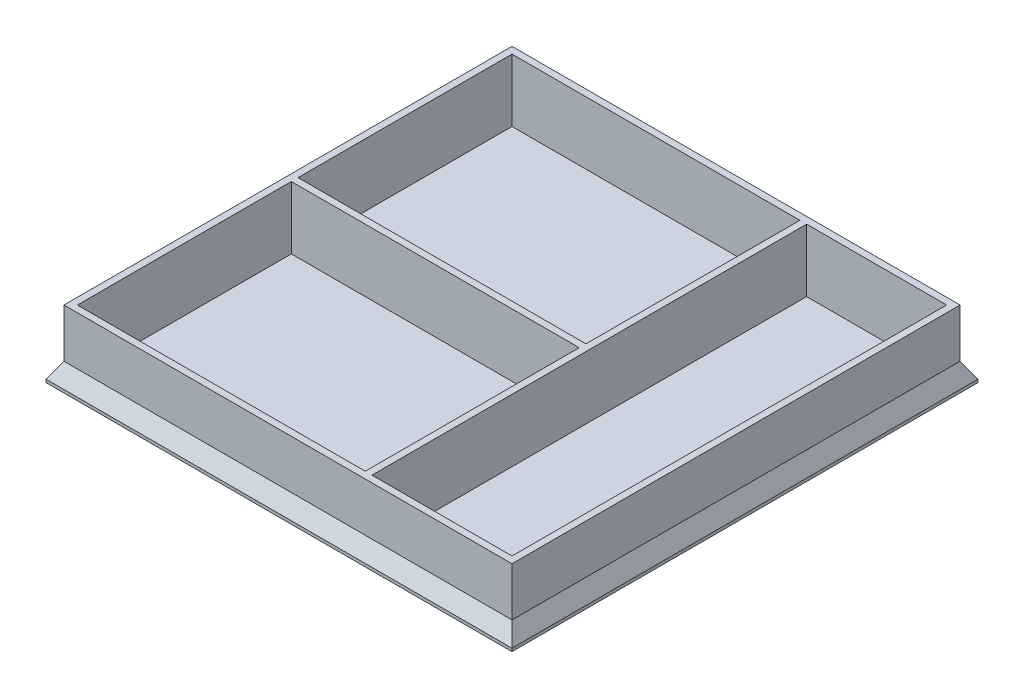
ISO-10303-21;
HEADER;
FILE_DESCRIPTION(('STEP AP214'),'2;1');
FILE_NAME('part.step','',(''),(''),'','','');
FILE_SCHEMA(('AUTOMOTIVE_DESIGN { 1 0 10303 214 1 1 1 1 }'));
ENDSEC;
DATA;
#1=APPLICATION_CONTEXT('core data for automotive mechanical design processes');
#2=APPLICATION_PROTOCOL_DEFINITION('international standard','automotive_design',2000,#1);
#3=PRODUCT_CONTEXT('',#1,'mechanical');
#4=PRODUCT('Part','Part','',(#3));
#5=PRODUCT_RELATED_PRODUCT_CATEGORY('part','',(#4));
#6=PRODUCT_DEFINITION_FORMATION('','',#4);
#7=PRODUCT_DEFINITION_CONTEXT('part definition',#1,'design');
#8=PRODUCT_DEFINITION('design','',#6,#7);
#9=PRODUCT_DEFINITION_SHAPE('','',#8);
#10=(LENGTH_UNIT() NAMED_UNIT(*) SI_UNIT(.MILLI.,.METRE.));
#11=(NAMED_UNIT(*) PLANE_ANGLE_UNIT() SI_UNIT($,.RADIAN.));
#12=(NAMED_UNIT(*) SI_UNIT($,.STERADIAN.) SOLID_ANGLE_UNIT());
#13=UNCERTAINTY_MEASURE_WITH_UNIT(LENGTH_MEASURE(1.E-05),#10,'distance_accuracy_value','');
#14=(GEOMETRIC_REPRESENTATION_CONTEXT(3) GLOBAL_UNCERTAINTY_ASSIGNED_CONTEXT((#13)) GLOBAL_UNIT_ASSIGNED_CONTEXT((#10,
#11,#12)) REPRESENTATION_CONTEXT('',''));
#15=CARTESIAN_POINT('',(0.,0.,0.));
#16=DIRECTION('',(0.,0.,1.));
#17=DIRECTION('',(1.,0.,0.));
#18=AXIS2_PLACEMENT_3D('',#15,#16,#17);
#19=CARTESIAN_POINT('',(0.,12.,-41.));
#20=DIRECTION('',(0.,0.,-1.));
#21=DIRECTION('',(-1.,0.,0.));
#22=AXIS2_PLACEMENT_3D('',#19,#20,#21);
#23=PLANE('',#22);
#24=DIRECTION('',(-1.,0.,0.));
#25=VECTOR('',#24,1.);
#26=CARTESIAN_POINT('',(0.,0.8,-41.));
#27=LINE('',#26,#25);
#28=CARTESIAN_POINT('',(-29.,0.8,-41.));
#29=VERTEX_POINT('',#28);
#30=CARTESIAN_POINT('',(-80.4,0.8,-41.));
#31=VERTEX_POINT('',#30);
#32=EDGE_CURVE('E306',#29,#31,#27,.T.);
#33=ORIENTED_EDGE('',*,*,#32,.F.);
#34=DIRECTION('',(0.,-1.,0.));
#35=VECTOR('',#34,1.);
#36=CARTESIAN_POINT('',(-29.,12.,-41.));
#37=LINE('',#36,#35);
#38=CARTESIAN_POINT('',(-29.,12.,-41.));
#39=VERTEX_POINT('',#38);
#40=EDGE_CURVE('E250',#39,#29,#37,.T.);
#41=ORIENTED_EDGE('',*,*,#40,.F.);
#42=DIRECTION('',(1.,0.,0.));
#43=VECTOR('',#42,1.);
#44=CARTESIAN_POINT('',(0.,12.,-41.));
#45=LINE('',#44,#43);
#46=CARTESIAN_POINT('',(-80.4,12.,-41.));
#47=VERTEX_POINT('',#46);
#48=EDGE_CURVE('E229',#47,#39,#45,.T.);
#49=ORIENTED_EDGE('',*,*,#48,.F.);
#50=DIRECTION('',(0.,-1.,0.));
#51=VECTOR('',#50,1.);
#52=CARTESIAN_POINT('',(-80.4,12.,-41.));
#53=LINE('',#52,#51);
#54=EDGE_CURVE('E240',#47,#31,#53,.T.);
#55=ORIENTED_EDGE('',*,*,#54,.T.);
#56=EDGE_LOOP('',(#33,#41,#49,#55));
#57=FACE_BOUND('',#56,.T.);
#58=ADVANCED_FACE('F37',(#57),#23,.F.);
#59=CARTESIAN_POINT('',(-29.,12.,0.));
#60=DIRECTION('',(1.,0.,0.));
#61=DIRECTION('',(0.,0.,-1.));
#62=AXIS2_PLACEMENT_3D('',#59,#60,#61);
#63=PLANE('',#62);
#64=DIRECTION('',(0.,0.,-1.));
#65=VECTOR('',#64,1.);
#66=CARTESIAN_POINT('',(-29.,0.8,0.));
#67=LINE('',#66,#65);
#68=CARTESIAN_POINT('',(-29.,0.8,-2.79999999999999));
#69=VERTEX_POINT('',#68);
#70=EDGE_CURVE('E304',#69,#29,#67,.T.);
#71=ORIENTED_EDGE('',*,*,#70,.F.);
#72=DIRECTION('',(0.,-1.,0.));
#73=VECTOR('',#72,1.);
#74=CARTESIAN_POINT('',(-29.,12.,-2.79999999999999));
#75=LINE('',#74,#73);
#76=CARTESIAN_POINT('',(-29.,12.,-2.79999999999999));
#77=VERTEX_POINT('',#76);
#78=EDGE_CURVE('E247',#77,#69,#75,.T.);
#79=ORIENTED_EDGE('',*,*,#78,.F.);
#80=DIRECTION('',(0.,0.,1.));
#81=VECTOR('',#80,1.);
#82=CARTESIAN_POINT('',(-29.,12.,0.));
#83=LINE('',#82,#81);
#84=EDGE_CURVE('E232',#39,#77,#83,.T.);
#85=ORIENTED_EDGE('',*,*,#84,.F.);
#86=ORIENTED_EDGE('',*,*,#40,.T.);
#87=EDGE_LOOP('',(#71,#79,#85,#86));
#88=FACE_BOUND('',#87,.T.);
#89=ADVANCED_FACE('F383',(#88),#63,.F.);
#90=CARTESIAN_POINT('',(0.,12.,-2.79999999999999));
#91=DIRECTION('',(0.,0.,-1.));
#92=DIRECTION('',(-1.,0.,0.));
#93=AXIS2_PLACEMENT_3D('',#90,#91,#92);
#94=PLANE('',#93);
#95=ORIENTED_EDGE('',*,*,#78,.T.);
#96=DIRECTION('',(-1.,0.,0.));
#97=VECTOR('',#96,1.);
#98=CARTESIAN_POINT('',(0.,0.8,-2.79999999999999));
#99=LINE('',#98,#97);
#100=CARTESIAN_POINT('',(-80.4,0.8,-2.79999999999999));
#101=VERTEX_POINT('',#100);
#102=EDGE_CURVE('E301',#69,#101,#99,.T.);
#103=ORIENTED_EDGE('',*,*,#102,.T.);
#104=DIRECTION('',(0.,-1.,0.));
#105=VECTOR('',#104,1.);
#106=CARTESIAN_POINT('',(-80.4,12.,-2.79999999999999));
#107=LINE('',#106,#105);
#108=CARTESIAN_POINT('',(-80.4,12.,-2.79999999999999));
#109=VERTEX_POINT('',#108);
#110=EDGE_CURVE('E243',#109,#101,#107,.T.);
#111=ORIENTED_EDGE('',*,*,#110,.F.);
#112=DIRECTION('',(1.,0.,0.));
#113=VECTOR('',#112,1.);
#114=CARTESIAN_POINT('',(0.,12.,-2.79999999999999));
#115=LINE('',#114,#113);
#116=EDGE_CURVE('E234',#109,#77,#115,.T.);
#117=ORIENTED_EDGE('',*,*,#116,.T.);
#118=EDGE_LOOP('',(#95,#103,#111,#117));
#119=FACE_BOUND('',#118,.T.);
#120=ADVANCED_FACE('F389',(#119),#94,.T.);
#121=CARTESIAN_POINT('',(0.,12.,-80.4));
#122=DIRECTION('',(0.,0.,-1.));
#123=DIRECTION('',(-1.,0.,0.));
#124=AXIS2_PLACEMENT_3D('',#121,#122,#123);
#125=PLANE('',#124);
#126=DIRECTION('',(-1.,0.,0.));
#127=VECTOR('',#126,1.);
#128=CARTESIAN_POINT('',(0.,0.8,-80.4));
#129=LINE('',#128,#127);
#130=CARTESIAN_POINT('',(-29.,0.8,-80.4));
#131=VERTEX_POINT('',#130);
#132=CARTESIAN_POINT('',(-80.4,0.8,-80.4));
#133=VERTEX_POINT('',#132);
#134=EDGE_CURVE('E299',#131,#133,#129,.T.);
#135=ORIENTED_EDGE('',*,*,#134,.F.);
#136=DIRECTION('',(0.,-1.,0.));
#137=VECTOR('',#136,1.);
#138=CARTESIAN_POINT('',(-29.,12.,-80.4));
#139=LINE('',#138,#137);
#140=CARTESIAN_POINT('',(-29.,12.,-80.4));
#141=VERTEX_POINT('',#140);
#142=EDGE_CURVE('E244',#141,#131,#139,.T.);
#143=ORIENTED_EDGE('',*,*,#142,.F.);
#144=DIRECTION('',(1.,0.,0.));
#145=VECTOR('',#144,1.);
#146=CARTESIAN_POINT('',(0.,12.,-80.4));
#147=LINE('',#146,#145);
#148=CARTESIAN_POINT('',(-80.4,12.,-80.4));
#149=VERTEX_POINT('',#148);
#150=EDGE_CURVE('E218',#149,#141,#147,.T.);
#151=ORIENTED_EDGE('',*,*,#150,.F.);
#152=DIRECTION('',(0.,-1.,0.));
#153=VECTOR('',#152,1.);
#154=CARTESIAN_POINT('',(-80.4,12.,-80.4));
#155=LINE('',#154,#153);
#156=EDGE_CURVE('E254',#149,#133,#155,.T.);
#157=ORIENTED_EDGE('',*,*,#156,.T.);
#158=EDGE_LOOP('',(#135,#143,#151,#157));
#159=FACE_BOUND('',#158,.T.);
#160=ADVANCED_FACE('F406',(#159),#125,.F.);
#161=CARTESIAN_POINT('',(-29.,12.,0.));
#162=DIRECTION('',(1.,0.,0.));
#163=DIRECTION('',(0.,0.,-1.));
#164=AXIS2_PLACEMENT_3D('',#161,#162,#163);
#165=PLANE('',#164);
#166=DIRECTION('',(0.,0.,-1.));
#167=VECTOR('',#166,1.);
#168=CARTESIAN_POINT('',(-29.,0.8,0.));
#169=LINE('',#168,#167);
#170=CARTESIAN_POINT('',(-29.,0.8,-42.2));
#171=VERTEX_POINT('',#170);
#172=EDGE_CURVE('E297',#171,#131,#169,.T.);
#173=ORIENTED_EDGE('',*,*,#172,.F.);
#174=DIRECTION('',(0.,-1.,0.));
#175=VECTOR('',#174,1.);
#176=CARTESIAN_POINT('',(-29.,12.,-42.2));
#177=LINE('',#176,#175);
#178=CARTESIAN_POINT('',(-29.,12.,-42.2));
#179=VERTEX_POINT('',#178);
#180=EDGE_CURVE('E261',#179,#171,#177,.T.);
#181=ORIENTED_EDGE('',*,*,#180,.F.);
#182=DIRECTION('',(0.,0.,1.));
#183=VECTOR('',#182,1.);
#184=CARTESIAN_POINT('',(-29.,12.,0.));
#185=LINE('',#184,#183);
#186=EDGE_CURVE('E221',#141,#179,#185,.T.);
#187=ORIENTED_EDGE('',*,*,#186,.F.);
#188=ORIENTED_EDGE('',*,*,#142,.T.);
#189=EDGE_LOOP('',(#173,#181,#187,#188));
#190=FACE_BOUND('',#189,.T.);
#191=ADVANCED_FACE('F402',(#190),#165,.F.);
#192=CARTESIAN_POINT('',(0.,12.,-42.2));
#193=DIRECTION('',(0.,0.,-1.));
#194=DIRECTION('',(-1.,0.,0.));
#195=AXIS2_PLACEMENT_3D('',#192,#193,#194);
#196=PLANE('',#195);
#197=ORIENTED_EDGE('',*,*,#180,.T.);
#198=DIRECTION('',(-1.,0.,0.));
#199=VECTOR('',#198,1.);
#200=CARTESIAN_POINT('',(0.,0.8,-42.2));
#201=LINE('',#200,#199);
#202=CARTESIAN_POINT('',(-80.4,0.8,-42.2));
#203=VERTEX_POINT('',#202);
#204=EDGE_CURVE('E294',#171,#203,#201,.T.);
#205=ORIENTED_EDGE('',*,*,#204,.T.);
#206=DIRECTION('',(0.,-1.,0.));
#207=VECTOR('',#206,1.);
#208=CARTESIAN_POINT('',(-80.4,12.,-42.2));
#209=LINE('',#208,#207);
#210=CARTESIAN_POINT('',(-80.4,12.,-42.2));
#211=VERTEX_POINT('',#210);
#212=EDGE_CURVE('E257',#211,#203,#209,.T.);
#213=ORIENTED_EDGE('',*,*,#212,.F.);
#214=DIRECTION('',(1.,0.,0.));
#215=VECTOR('',#214,1.);
#216=CARTESIAN_POINT('',(0.,12.,-42.2));
#217=LINE('',#216,#215);
#218=EDGE_CURVE('E223',#211,#179,#217,.T.);
#219=ORIENTED_EDGE('',*,*,#218,.T.);
#220=EDGE_LOOP('',(#197,#205,#213,#219));
#221=FACE_BOUND('',#220,.T.);
#222=ADVANCED_FACE('F398',(#221),#196,.T.);
#223=CARTESIAN_POINT('',(0.,12.,-80.4));
#224=DIRECTION('',(0.,0.,-1.));
#225=DIRECTION('',(-1.,0.,0.));
#226=AXIS2_PLACEMENT_3D('',#223,#224,#225);
#227=PLANE('',#226);
#228=DIRECTION('',(-1.,0.,0.));
#229=VECTOR('',#228,1.);
#230=CARTESIAN_POINT('',(0.,0.8,-80.4));
#231=LINE('',#230,#229);
#232=CARTESIAN_POINT('',(-2.79999999999998,0.8,-80.4));
#233=VERTEX_POINT('',#232);
#234=CARTESIAN_POINT('',(-27.8,0.8,-80.4));
#235=VERTEX_POINT('',#234);
#236=EDGE_CURVE('E292',#233,#235,#231,.T.);
#237=ORIENTED_EDGE('',*,*,#236,.F.);
#238=DIRECTION('',(0.,-1.,0.));
#239=VECTOR('',#238,1.);
#240=CARTESIAN_POINT('',(-2.79999999999998,12.,-80.4));
#241=LINE('',#240,#239);
#242=CARTESIAN_POINT('',(-2.79999999999998,12.,-80.4));
#243=VERTEX_POINT('',#242);
#244=EDGE_CURVE('E258',#243,#233,#241,.T.);
#245=ORIENTED_EDGE('',*,*,#244,.F.);
#246=DIRECTION('',(1.,0.,0.));
#247=VECTOR('',#246,1.);
#248=CARTESIAN_POINT('',(0.,12.,-80.4));
#249=LINE('',#248,#247);
#250=CARTESIAN_POINT('',(-27.8,12.,-80.4));
#251=VERTEX_POINT('',#250);
#252=EDGE_CURVE('E207',#251,#243,#249,.T.);
#253=ORIENTED_EDGE('',*,*,#252,.F.);
#254=DIRECTION('',(0.,-1.,0.));
#255=VECTOR('',#254,1.);
#256=CARTESIAN_POINT('',(-27.8,12.,-80.4));
#257=LINE('',#256,#255);
#258=EDGE_CURVE('E190',#251,#235,#257,.T.);
#259=ORIENTED_EDGE('',*,*,#258,.T.);
#260=EDGE_LOOP('',(#237,#245,#253,#259));
#261=FACE_BOUND('',#260,.T.);
#262=ADVANCED_FACE('F401',(#261),#227,.F.);
#263=CARTESIAN_POINT('',(-2.79999999999997,12.,0.));
#264=DIRECTION('',(1.,0.,0.));
#265=DIRECTION('',(0.,0.,-1.));
#266=AXIS2_PLACEMENT_3D('',#263,#264,#265);
#267=PLANE('',#266);
#268=DIRECTION('',(0.,0.,-1.));
#269=VECTOR('',#268,1.);
#270=CARTESIAN_POINT('',(-2.79999999999997,0.8,0.));
#271=LINE('',#270,#269);
#272=CARTESIAN_POINT('',(-2.79999999999997,0.8,-2.79999999999999));
#273=VERTEX_POINT('',#272);
#274=EDGE_CURVE('E290',#273,#233,#271,.T.);
#275=ORIENTED_EDGE('',*,*,#274,.F.);
#276=DIRECTION('',(0.,-1.,0.));
#277=VECTOR('',#276,1.);
#278=CARTESIAN_POINT('',(-2.79999999999997,12.,-2.79999999999999));
#279=LINE('',#278,#277);
#280=CARTESIAN_POINT('',(-2.79999999999997,12.,-2.79999999999999));
#281=VERTEX_POINT('',#280);
#282=EDGE_CURVE('E271',#281,#273,#279,.T.);
#283=ORIENTED_EDGE('',*,*,#282,.F.);
#284=DIRECTION('',(0.,0.,1.));
#285=VECTOR('',#284,1.);
#286=CARTESIAN_POINT('',(-2.79999999999997,12.,0.));
#287=LINE('',#286,#285);
#288=EDGE_CURVE('E210',#243,#281,#287,.T.);
#289=ORIENTED_EDGE('',*,*,#288,.F.);
#290=ORIENTED_EDGE('',*,*,#244,.T.);
#291=EDGE_LOOP('',(#275,#283,#289,#290));
#292=FACE_BOUND('',#291,.T.);
#293=ADVANCED_FACE('F414',(#292),#267,.F.);
#294=CARTESIAN_POINT('',(0.,12.,-2.79999999999999));
#295=DIRECTION('',(0.,0.,-1.));
#296=DIRECTION('',(-1.,0.,0.));
#297=AXIS2_PLACEMENT_3D('',#294,#295,#296);
#298=PLANE('',#297);
#299=ORIENTED_EDGE('',*,*,#282,.T.);
#300=DIRECTION('',(-1.,0.,0.));
#301=VECTOR('',#300,1.);
#302=CARTESIAN_POINT('',(0.,0.8,-2.79999999999999));
#303=LINE('',#302,#301);
#304=CARTESIAN_POINT('',(-27.8,0.8,-2.79999999999999));
#305=VERTEX_POINT('',#304);
#306=EDGE_CURVE('E287',#273,#305,#303,.T.);
#307=ORIENTED_EDGE('',*,*,#306,.T.);
#308=DIRECTION('',(0.,-1.,0.));
#309=VECTOR('',#308,1.);
#310=CARTESIAN_POINT('',(-27.8,12.,-2.79999999999999));
#311=LINE('',#310,#309);
#312=CARTESIAN_POINT('',(-27.8,12.,-2.79999999999999));
#313=VERTEX_POINT('',#312);
#314=EDGE_CURVE('E268',#313,#305,#311,.T.);
#315=ORIENTED_EDGE('',*,*,#314,.F.);
#316=DIRECTION('',(1.,0.,0.));
#317=VECTOR('',#316,1.);
#318=CARTESIAN_POINT('',(0.,12.,-2.79999999999999));
#319=LINE('',#318,#317);
#320=EDGE_CURVE('E212',#313,#281,#319,.T.);
#321=ORIENTED_EDGE('',*,*,#320,.T.);
#322=EDGE_LOOP('',(#299,#307,#315,#321));
#323=FACE_BOUND('',#322,.T.);
#324=ADVANCED_FACE('F411',(#323),#298,.T.);
#325=CARTESIAN_POINT('',(-1.59999999999997,12.,0.));
#326=DIRECTION('',(1.,0.,0.));
#327=DIRECTION('',(0.,0.,-1.));
#328=AXIS2_PLACEMENT_3D('',#325,#326,#327);
#329=PLANE('',#328);
#330=DIRECTION('',(0.,-1.,0.));
#331=VECTOR('',#330,1.);
#332=CARTESIAN_POINT('',(-1.59999999999997,12.,-1.59999999999998));
#333=LINE('',#332,#331);
#334=CARTESIAN_POINT('',(-1.59999999999997,12.,-1.59999999999998));
#335=VERTEX_POINT('',#334);
#336=CARTESIAN_POINT('',(-1.59999999999997,3.30717967697235,-1.59999999999998));
#337=VERTEX_POINT('',#336);
#338=EDGE_CURVE('E55',#335,#337,#333,.T.);
#339=ORIENTED_EDGE('',*,*,#338,.T.);
#340=DIRECTION('',(0.,0.,-1.));
#341=VECTOR('',#340,1.);
#342=CARTESIAN_POINT('',(-1.59999999999997,3.30717967697235,0.));
#343=LINE('',#342,#341);
#344=CARTESIAN_POINT('',(-1.59999999999997,3.30717967697238,-81.6));
#345=VERTEX_POINT('',#344);
#346=EDGE_CURVE('E47',#337,#345,#343,.T.);
#347=ORIENTED_EDGE('',*,*,#346,.T.);
#348=DIRECTION('',(0.,-1.,0.));
#349=VECTOR('',#348,1.);
#350=CARTESIAN_POINT('',(-1.59999999999997,12.,-81.6));
#351=LINE('',#350,#349);
#352=CARTESIAN_POINT('',(-1.59999999999997,12.,-81.6));
#353=VERTEX_POINT('',#352);
#354=EDGE_CURVE('E63',#353,#345,#351,.T.);
#355=ORIENTED_EDGE('',*,*,#354,.F.);
#356=DIRECTION('',(0.,0.,1.));
#357=VECTOR('',#356,1.);
#358=CARTESIAN_POINT('',(-1.59999999999997,12.,0.));
#359=LINE('',#358,#357);
#360=EDGE_CURVE('E187',#353,#335,#359,.T.);
#361=ORIENTED_EDGE('',*,*,#360,.T.);
#362=EDGE_LOOP('',(#339,#347,#355,#361));
#363=FACE_BOUND('',#362,.T.);
#364=ADVANCED_FACE('F186',(#363),#329,.T.);
#365=CARTESIAN_POINT('',(0.,12.,-81.6));
#366=DIRECTION('',(0.,0.,-1.));
#367=DIRECTION('',(-1.,0.,0.));
#368=AXIS2_PLACEMENT_3D('',#365,#366,#367);
#369=PLANE('',#368);
#370=ORIENTED_EDGE('',*,*,#354,.T.);
#371=DIRECTION('',(-1.,0.,0.));
#372=VECTOR('',#371,1.);
#373=CARTESIAN_POINT('',(0.,3.30717967697238,-81.6));
#374=LINE('',#373,#372);
#375=CARTESIAN_POINT('',(-81.6,3.30717967697242,-81.6));
#376=VERTEX_POINT('',#375);
#377=EDGE_CURVE('E339',#345,#376,#374,.T.);
#378=ORIENTED_EDGE('',*,*,#377,.T.);
#379=DIRECTION('',(0.,-1.,0.));
#380=VECTOR('',#379,1.);
#381=CARTESIAN_POINT('',(-81.6,12.,-81.6));
#382=LINE('',#381,#380);
#383=CARTESIAN_POINT('',(-81.6,12.,-81.6));
#384=VERTEX_POINT('',#383);
#385=EDGE_CURVE('E191',#384,#376,#382,.T.);
#386=ORIENTED_EDGE('',*,*,#385,.F.);
#387=DIRECTION('',(1.,0.,0.));
#388=VECTOR('',#387,1.);
#389=CARTESIAN_POINT('',(0.,12.,-81.6));
#390=LINE('',#389,#388);
#391=EDGE_CURVE('E197',#384,#353,#390,.T.);
#392=ORIENTED_EDGE('',*,*,#391,.T.);
#393=EDGE_LOOP('',(#370,#378,#386,#392));
#394=FACE_BOUND('',#393,.T.);
#395=ADVANCED_FACE('F200',(#394),#369,.T.);
#396=CARTESIAN_POINT('',(-81.6,12.,0.));
#397=DIRECTION('',(1.,0.,0.));
#398=DIRECTION('',(0.,0.,-1.));
#399=AXIS2_PLACEMENT_3D('',#396,#397,#398);
#400=PLANE('',#399);
#401=ORIENTED_EDGE('',*,*,#385,.T.);
#402=DIRECTION('',(0.,0.,-1.));
#403=VECTOR('',#402,1.);
#404=CARTESIAN_POINT('',(-81.6,3.30717967697242,0.));
#405=LINE('',#404,#403);
#406=CARTESIAN_POINT('',(-81.6,3.3071796769724,-1.59999999999999));
#407=VERTEX_POINT('',#406);
#408=EDGE_CURVE('E336',#376,#407,#405,.F.);
#409=ORIENTED_EDGE('',*,*,#408,.T.);
#410=DIRECTION('',(0.,-1.,0.));
#411=VECTOR('',#410,1.);
#412=CARTESIAN_POINT('',(-81.6,12.,-1.59999999999999));
#413=LINE('',#412,#411);
#414=CARTESIAN_POINT('',(-81.6,12.,-1.59999999999999));
#415=VERTEX_POINT('',#414);
#416=EDGE_CURVE('E73',#415,#407,#413,.T.);
#417=ORIENTED_EDGE('',*,*,#416,.F.);
#418=DIRECTION('',(0.,0.,1.));
#419=VECTOR('',#418,1.);
#420=CARTESIAN_POINT('',(-81.6,12.,0.));
#421=LINE('',#420,#419);
#422=EDGE_CURVE('E202',#384,#415,#421,.T.);
#423=ORIENTED_EDGE('',*,*,#422,.F.);
#424=EDGE_LOOP('',(#401,#409,#417,#423));
#425=FACE_BOUND('',#424,.T.);
#426=ADVANCED_FACE('F365',(#425),#400,.F.);
#427=CARTESIAN_POINT('',(-80.4,12.,0.));
#428=DIRECTION('',(1.,0.,0.));
#429=DIRECTION('',(0.,0.,-1.));
#430=AXIS2_PLACEMENT_3D('',#427,#428,#429);
#431=PLANE('',#430);
#432=ORIENTED_EDGE('',*,*,#212,.T.);
#433=DIRECTION('',(0.,0.,-1.));
#434=VECTOR('',#433,1.);
#435=CARTESIAN_POINT('',(-80.4,0.8,0.));
#436=LINE('',#435,#434);
#437=EDGE_CURVE('E284',#203,#133,#436,.T.);
#438=ORIENTED_EDGE('',*,*,#437,.T.);
#439=ORIENTED_EDGE('',*,*,#156,.F.);
#440=DIRECTION('',(0.,0.,1.));
#441=VECTOR('',#440,1.);
#442=CARTESIAN_POINT('',(-80.4,12.,0.));
#443=LINE('',#442,#441);
#444=EDGE_CURVE('E226',#149,#211,#443,.T.);
#445=ORIENTED_EDGE('',*,*,#444,.T.);
#446=EDGE_LOOP('',(#432,#438,#439,#445));
#447=FACE_BOUND('',#446,.T.);
#448=ADVANCED_FACE('F377',(#447),#431,.T.);
#449=CARTESIAN_POINT('',(-27.8,12.,0.));
#450=DIRECTION('',(1.,0.,0.));
#451=DIRECTION('',(0.,0.,-1.));
#452=AXIS2_PLACEMENT_3D('',#449,#450,#451);
#453=PLANE('',#452);
#454=ORIENTED_EDGE('',*,*,#314,.T.);
#455=DIRECTION('',(0.,0.,-1.));
#456=VECTOR('',#455,1.);
#457=CARTESIAN_POINT('',(-27.8,0.8,0.));
#458=LINE('',#457,#456);
#459=EDGE_CURVE('E281',#305,#235,#458,.T.);
#460=ORIENTED_EDGE('',*,*,#459,.T.);
#461=ORIENTED_EDGE('',*,*,#258,.F.);
#462=DIRECTION('',(0.,0.,1.));
#463=VECTOR('',#462,1.);
#464=CARTESIAN_POINT('',(-27.8,12.,0.));
#465=LINE('',#464,#463);
#466=EDGE_CURVE('E215',#251,#313,#465,.T.);
#467=ORIENTED_EDGE('',*,*,#466,.T.);
#468=EDGE_LOOP('',(#454,#460,#461,#467));
#469=FACE_BOUND('',#468,.T.);
#470=ADVANCED_FACE('F369',(#469),#453,.T.);
#471=CARTESIAN_POINT('',(0.,12.,-1.59999999999998));
#472=DIRECTION('',(0.,0.,-1.));
#473=DIRECTION('',(-1.,0.,0.));
#474=AXIS2_PLACEMENT_3D('',#471,#472,#473);
#475=PLANE('',#474);
#476=ORIENTED_EDGE('',*,*,#416,.T.);
#477=DIRECTION('',(-1.,0.,0.));
#478=VECTOR('',#477,1.);
#479=CARTESIAN_POINT('',(0.,3.30717967697236,-1.59999999999998));
#480=LINE('',#479,#478);
#481=EDGE_CURVE('E11',#407,#337,#480,.F.);
#482=ORIENTED_EDGE('',*,*,#481,.T.);
#483=ORIENTED_EDGE('',*,*,#338,.F.);
#484=DIRECTION('',(1.,0.,0.));
#485=VECTOR('',#484,1.);
#486=CARTESIAN_POINT('',(0.,12.,-1.59999999999998));
#487=LINE('',#486,#485);
#488=EDGE_CURVE('E198',#415,#335,#487,.T.);
#489=ORIENTED_EDGE('',*,*,#488,.F.);
#490=EDGE_LOOP('',(#476,#482,#483,#489));
#491=FACE_BOUND('',#490,.T.);
#492=ADVANCED_FACE('F366',(#491),#475,.F.);
#493=CARTESIAN_POINT('',(-80.4,12.,0.));
#494=DIRECTION('',(1.,0.,0.));
#495=DIRECTION('',(0.,0.,-1.));
#496=AXIS2_PLACEMENT_3D('',#493,#494,#495);
#497=PLANE('',#496);
#498=ORIENTED_EDGE('',*,*,#110,.T.);
#499=DIRECTION('',(0.,0.,-1.));
#500=VECTOR('',#499,1.);
#501=CARTESIAN_POINT('',(-80.4,0.8,0.));
#502=LINE('',#501,#500);
#503=EDGE_CURVE('E253',#101,#31,#502,.T.);
#504=ORIENTED_EDGE('',*,*,#503,.T.);
#505=ORIENTED_EDGE('',*,*,#54,.F.);
#506=DIRECTION('',(0.,0.,1.));
#507=VECTOR('',#506,1.);
#508=CARTESIAN_POINT('',(-80.4,12.,0.));
#509=LINE('',#508,#507);
#510=EDGE_CURVE('E237',#47,#109,#509,.T.);
#511=ORIENTED_EDGE('',*,*,#510,.T.);
#512=EDGE_LOOP('',(#498,#504,#505,#511));
#513=FACE_BOUND('',#512,.T.);
#514=ADVANCED_FACE('F368',(#513),#497,.T.);
#515=CARTESIAN_POINT('',(0.,12.,0.));
#516=DIRECTION('',(0.,1.,0.));
#517=DIRECTION('',(0.,0.,1.));
#518=AXIS2_PLACEMENT_3D('',#515,#516,#517);
#519=PLANE('',#518);
#520=ORIENTED_EDGE('',*,*,#360,.F.);
#521=ORIENTED_EDGE('',*,*,#391,.F.);
#522=ORIENTED_EDGE('',*,*,#422,.T.);
#523=ORIENTED_EDGE('',*,*,#488,.T.);
#524=EDGE_LOOP('',(#520,#521,#522,#523));
#525=FACE_BOUND('',#524,.T.);
#526=ORIENTED_EDGE('',*,*,#252,.T.);
#527=ORIENTED_EDGE('',*,*,#288,.T.);
#528=ORIENTED_EDGE('',*,*,#320,.F.);
#529=ORIENTED_EDGE('',*,*,#466,.F.);
#530=EDGE_LOOP('',(#526,#527,#528,#529));
#531=FACE_BOUND('',#530,.T.);
#532=ORIENTED_EDGE('',*,*,#150,.T.);
#533=ORIENTED_EDGE('',*,*,#186,.T.);
#534=ORIENTED_EDGE('',*,*,#218,.F.);
#535=ORIENTED_EDGE('',*,*,#444,.F.);
#536=EDGE_LOOP('',(#532,#533,#534,#535));
#537=FACE_BOUND('',#536,.T.);
#538=ORIENTED_EDGE('',*,*,#48,.T.);
#539=ORIENTED_EDGE('',*,*,#84,.T.);
#540=ORIENTED_EDGE('',*,*,#116,.F.);
#541=ORIENTED_EDGE('',*,*,#510,.F.);
#542=EDGE_LOOP('',(#538,#539,#540,#541));
#543=FACE_BOUND('',#542,.T.);
#544=ADVANCED_FACE('F195',(#525,#531,#537,#543),#519,.T.);
#545=CARTESIAN_POINT('',(0.,0.8,0.));
#546=DIRECTION('',(0.,1.,0.));
#547=DIRECTION('',(0.,0.,1.));
#548=AXIS2_PLACEMENT_3D('',#545,#546,#547);
#549=PLANE('',#548);
#550=ORIENTED_EDGE('',*,*,#70,.T.);
#551=ORIENTED_EDGE('',*,*,#32,.T.);
#552=ORIENTED_EDGE('',*,*,#503,.F.);
#553=ORIENTED_EDGE('',*,*,#102,.F.);
#554=EDGE_LOOP('',(#550,#551,#552,#553));
#555=FACE_BOUND('',#554,.T.);
#556=ADVANCED_FACE('F434',(#555),#549,.T.);
#557=ORIENTED_EDGE('',*,*,#274,.T.);
#558=ORIENTED_EDGE('',*,*,#236,.T.);
#559=ORIENTED_EDGE('',*,*,#459,.F.);
#560=ORIENTED_EDGE('',*,*,#306,.F.);
#561=EDGE_LOOP('',(#557,#558,#559,#560));
#562=FACE_BOUND('',#561,.T.);
#563=ADVANCED_FACE('F431',(#562),#549,.T.);
#564=ORIENTED_EDGE('',*,*,#172,.T.);
#565=ORIENTED_EDGE('',*,*,#134,.T.);
#566=ORIENTED_EDGE('',*,*,#437,.F.);
#567=ORIENTED_EDGE('',*,*,#204,.F.);
#568=EDGE_LOOP('',(#564,#565,#566,#567));
#569=FACE_BOUND('',#568,.T.);
#570=ADVANCED_FACE('F433',(#569),#549,.T.);
#571=CARTESIAN_POINT('',(0.,0.,0.));
#572=DIRECTION('',(0.,1.,0.));
#573=DIRECTION('',(0.,0.,1.));
#574=AXIS2_PLACEMENT_3D('',#571,#572,#573);
#575=PLANE('',#574);
#576=DIRECTION('',(0.,0.,-1.));
#577=VECTOR('',#576,1.);
#578=CARTESIAN_POINT('',(0.,0.,0.));
#579=LINE('',#578,#577);
#580=CARTESIAN_POINT('',(0.,0.,0.));
#581=VERTEX_POINT('',#580);
#582=CARTESIAN_POINT('',(0.,0.,-83.2));
#583=VERTEX_POINT('',#582);
#584=EDGE_CURVE('E308',#581,#583,#579,.T.);
#585=ORIENTED_EDGE('',*,*,#584,.F.);
#586=DIRECTION('',(-1.,0.,0.));
#587=VECTOR('',#586,1.);
#588=CARTESIAN_POINT('',(0.,0.,0.));
#589=LINE('',#588,#587);
#590=CARTESIAN_POINT('',(-83.2,0.,0.));
#591=VERTEX_POINT('',#590);
#592=EDGE_CURVE('E317',#581,#591,#589,.T.);
#593=ORIENTED_EDGE('',*,*,#592,.T.);
#594=DIRECTION('',(0.,0.,-1.));
#595=VECTOR('',#594,1.);
#596=CARTESIAN_POINT('',(-83.2,0.,0.));
#597=LINE('',#596,#595);
#598=CARTESIAN_POINT('',(-83.2,0.,-83.2));
#599=VERTEX_POINT('',#598);
#600=EDGE_CURVE('E314',#591,#599,#597,.T.);
#601=ORIENTED_EDGE('',*,*,#600,.T.);
#602=DIRECTION('',(-1.,0.,0.));
#603=VECTOR('',#602,1.);
#604=CARTESIAN_POINT('',(0.,0.,-83.2));
#605=LINE('',#604,#603);
#606=EDGE_CURVE('E311',#583,#599,#605,.T.);
#607=ORIENTED_EDGE('',*,*,#606,.F.);
#608=EDGE_LOOP('',(#585,#593,#601,#607));
#609=FACE_BOUND('',#608,.T.);
#610=ADVANCED_FACE('F440',(#609),#575,.F.);
#611=CARTESIAN_POINT('',(0.,0.8,-83.2));
#612=DIRECTION('',(0.,0.,1.));
#613=DIRECTION('',(1.,0.,0.));
#614=AXIS2_PLACEMENT_3D('',#611,#612,#613);
#615=PLANE('',#614);
#616=DIRECTION('',(0.,-1.,0.));
#617=VECTOR('',#616,1.);
#618=CARTESIAN_POINT('',(-83.2,0.8,-83.2));
#619=LINE('',#618,#617);
#620=CARTESIAN_POINT('',(-83.2,0.535898384862171,-83.2));
#621=VERTEX_POINT('',#620);
#622=EDGE_CURVE('E324',#621,#599,#619,.T.);
#623=ORIENTED_EDGE('',*,*,#622,.F.);
#624=DIRECTION('',(1.,0.,0.));
#625=VECTOR('',#624,1.);
#626=CARTESIAN_POINT('',(0.,0.535898384862171,-83.2));
#627=LINE('',#626,#625);
#628=CARTESIAN_POINT('',(0.,0.53589838486217,-83.2));
#629=VERTEX_POINT('',#628);
#630=EDGE_CURVE('E331',#621,#629,#627,.T.);
#631=ORIENTED_EDGE('',*,*,#630,.T.);
#632=DIRECTION('',(0.,-1.,0.));
#633=VECTOR('',#632,1.);
#634=CARTESIAN_POINT('',(0.,0.8,-83.2));
#635=LINE('',#634,#633);
#636=EDGE_CURVE('E326',#629,#583,#635,.T.);
#637=ORIENTED_EDGE('',*,*,#636,.T.);
#638=ORIENTED_EDGE('',*,*,#606,.T.);
#639=EDGE_LOOP('',(#623,#631,#637,#638));
#640=FACE_BOUND('',#639,.T.);
#641=ADVANCED_FACE('F448',(#640),#615,.F.);
#642=CARTESIAN_POINT('',(0.,0.8,0.));
#643=DIRECTION('',(-1.,0.,0.));
#644=DIRECTION('',(0.,0.,1.));
#645=AXIS2_PLACEMENT_3D('',#642,#643,#644);
#646=PLANE('',#645);
#647=ORIENTED_EDGE('',*,*,#636,.F.);
#648=DIRECTION('',(0.,0.,1.));
#649=VECTOR('',#648,1.);
#650=CARTESIAN_POINT('',(0.,0.53589838486217,0.));
#651=LINE('',#650,#649);
#652=CARTESIAN_POINT('',(0.,0.535898384862171,0.));
#653=VERTEX_POINT('',#652);
#654=EDGE_CURVE('E81',#629,#653,#651,.T.);
#655=ORIENTED_EDGE('',*,*,#654,.T.);
#656=DIRECTION('',(0.,-1.,0.));
#657=VECTOR('',#656,1.);
#658=CARTESIAN_POINT('',(0.,0.8,0.));
#659=LINE('',#658,#657);
#660=EDGE_CURVE('E320',#653,#581,#659,.T.);
#661=ORIENTED_EDGE('',*,*,#660,.T.);
#662=ORIENTED_EDGE('',*,*,#584,.T.);
#663=EDGE_LOOP('',(#647,#655,#661,#662));
#664=FACE_BOUND('',#663,.T.);
#665=ADVANCED_FACE('F454',(#664),#646,.F.);
#666=CARTESIAN_POINT('',(0.,0.8,0.));
#667=DIRECTION('',(0.,0.,1.));
#668=DIRECTION('',(1.,0.,0.));
#669=AXIS2_PLACEMENT_3D('',#666,#667,#668);
#670=PLANE('',#669);
#671=ORIENTED_EDGE('',*,*,#660,.F.);
#672=DIRECTION('',(-1.,0.,0.));
#673=VECTOR('',#672,1.);
#674=CARTESIAN_POINT('',(0.,0.535898384862171,0.));
#675=LINE('',#674,#673);
#676=CARTESIAN_POINT('',(-83.2,0.535898384862171,0.));
#677=VERTEX_POINT('',#676);
#678=EDGE_CURVE('E334',#653,#677,#675,.T.);
#679=ORIENTED_EDGE('',*,*,#678,.T.);
#680=DIRECTION('',(0.,-1.,0.));
#681=VECTOR('',#680,1.);
#682=CARTESIAN_POINT('',(-83.2,0.8,0.));
#683=LINE('',#682,#681);
#684=EDGE_CURVE('E322',#677,#591,#683,.T.);
#685=ORIENTED_EDGE('',*,*,#684,.T.);
#686=ORIENTED_EDGE('',*,*,#592,.F.);
#687=EDGE_LOOP('',(#671,#679,#685,#686));
#688=FACE_BOUND('',#687,.T.);
#689=ADVANCED_FACE('F450',(#688),#670,.T.);
#690=CARTESIAN_POINT('',(-83.2,0.8,0.));
#691=DIRECTION('',(-1.,0.,0.));
#692=DIRECTION('',(0.,0.,1.));
#693=AXIS2_PLACEMENT_3D('',#690,#691,#692);
#694=PLANE('',#693);
#695=ORIENTED_EDGE('',*,*,#684,.F.);
#696=DIRECTION('',(0.,0.,-1.));
#697=VECTOR('',#696,1.);
#698=CARTESIAN_POINT('',(-83.2,0.535898384862171,0.));
#699=LINE('',#698,#697);
#700=EDGE_CURVE('E328',#677,#621,#699,.T.);
#701=ORIENTED_EDGE('',*,*,#700,.T.);
#702=ORIENTED_EDGE('',*,*,#622,.T.);
#703=ORIENTED_EDGE('',*,*,#600,.F.);
#704=EDGE_LOOP('',(#695,#701,#702,#703));
#705=FACE_BOUND('',#704,.T.);
#706=ADVANCED_FACE('F453',(#705),#694,.T.);
#707=CARTESIAN_POINT('',(-2.00000000000002,4.,0.));
#708=DIRECTION('',(0.866025403784441,0.499999999999996,0.));
#709=DIRECTION('',(0.,0.,1.));
#710=AXIS2_PLACEMENT_3D('',#707,#708,#709);
#711=PLANE('',#710);
#712=DIRECTION('',(-0.447213595499955,0.774596669241486,0.447213595499956));
#713=VECTOR('',#712,1.);
#714=CARTESIAN_POINT('',(-18.2399999999999,32.1285051149185,-64.9600000000001));
#715=LINE('',#714,#713);
#716=EDGE_CURVE('E345',#345,#629,#715,.F.);
#717=ORIENTED_EDGE('',*,*,#716,.F.);
#718=ORIENTED_EDGE('',*,*,#346,.F.);
#719=DIRECTION('',(0.447213595499955,-0.774596669241486,0.447213595499955));
#720=VECTOR('',#719,1.);
#721=CARTESIAN_POINT('',(0.,0.535898384862171,0.));
#722=LINE('',#721,#720);
#723=EDGE_CURVE('E42',#653,#337,#722,.F.);
#724=ORIENTED_EDGE('',*,*,#723,.F.);
#725=ORIENTED_EDGE('',*,*,#654,.F.);
#726=EDGE_LOOP('',(#717,#718,#724,#725));
#727=FACE_BOUND('',#726,.T.);
#728=ADVANCED_FACE('F40',(#727),#711,.T.);
#729=CARTESIAN_POINT('',(0.,0.535898384862171,0.));
#730=DIRECTION('',(0.,-0.499999999999996,-0.866025403784441));
#731=DIRECTION('',(-1.,0.,0.));
#732=AXIS2_PLACEMENT_3D('',#729,#730,#731);
#733=PLANE('',#732);
#734=ORIENTED_EDGE('',*,*,#723,.T.);
#735=ORIENTED_EDGE('',*,*,#481,.F.);
#736=DIRECTION('',(-0.447213595499956,-0.774596669241486,0.447213595499955));
#737=VECTOR('',#736,1.);
#738=CARTESIAN_POINT('',(-66.5600000000001,29.3572238228083,-16.6399999999998));
#739=LINE('',#738,#737);
#740=EDGE_CURVE('E344',#677,#407,#739,.F.);
#741=ORIENTED_EDGE('',*,*,#740,.F.);
#742=ORIENTED_EDGE('',*,*,#678,.F.);
#743=EDGE_LOOP('',(#734,#735,#741,#742));
#744=FACE_BOUND('',#743,.T.);
#745=ADVANCED_FACE('F355',(#744),#733,.F.);
#746=CARTESIAN_POINT('',(0.,4.,-81.2));
#747=DIRECTION('',(0.,0.499999999999997,-0.86602540378444));
#748=DIRECTION('',(1.,0.,0.));
#749=AXIS2_PLACEMENT_3D('',#746,#747,#748);
#750=PLANE('',#749);
#751=ORIENTED_EDGE('',*,*,#716,.T.);
#752=ORIENTED_EDGE('',*,*,#630,.F.);
#753=DIRECTION('',(-0.447213595499956,-0.774596669241486,-0.447213595499956));
#754=VECTOR('',#753,1.);
#755=CARTESIAN_POINT('',(-64.9600000000001,32.1285051149185,-64.9600000000001));
#756=LINE('',#755,#754);
#757=EDGE_CURVE('E342',#376,#621,#756,.T.);
#758=ORIENTED_EDGE('',*,*,#757,.F.);
#759=ORIENTED_EDGE('',*,*,#377,.F.);
#760=EDGE_LOOP('',(#751,#752,#758,#759));
#761=FACE_BOUND('',#760,.T.);
#762=ADVANCED_FACE('F359',(#761),#750,.T.);
#763=CARTESIAN_POINT('',(-83.2,0.535898384862171,0.));
#764=DIRECTION('',(0.86602540378444,-0.499999999999997,0.));
#765=DIRECTION('',(0.,0.,-1.));
#766=AXIS2_PLACEMENT_3D('',#763,#764,#765);
#767=PLANE('',#766);
#768=ORIENTED_EDGE('',*,*,#740,.T.);
#769=ORIENTED_EDGE('',*,*,#408,.F.);
#770=ORIENTED_EDGE('',*,*,#757,.T.);
#771=ORIENTED_EDGE('',*,*,#700,.F.);
#772=EDGE_LOOP('',(#768,#769,#770,#771));
#773=FACE_BOUND('',#772,.T.);
#774=ADVANCED_FACE('F362',(#773),#767,.F.);
#775=CLOSED_SHELL('',(#58,#89,#120,#160,#191,#222,#262,#293,#324,#364,#395,#426,#448,#470,#492,
#514,#544,#556,#563,#570,#610,#641,#665,#689,#706,#728,#745,#762,#774));
#776=MANIFOLD_SOLID_BREP('B2',#775);
#777=ADVANCED_BREP_SHAPE_REPRESENTATION('',(#18,#776),#14);
#778=SHAPE_DEFINITION_REPRESENTATION(#9,#777);
ENDSEC;
END-ISO-10303-21;
